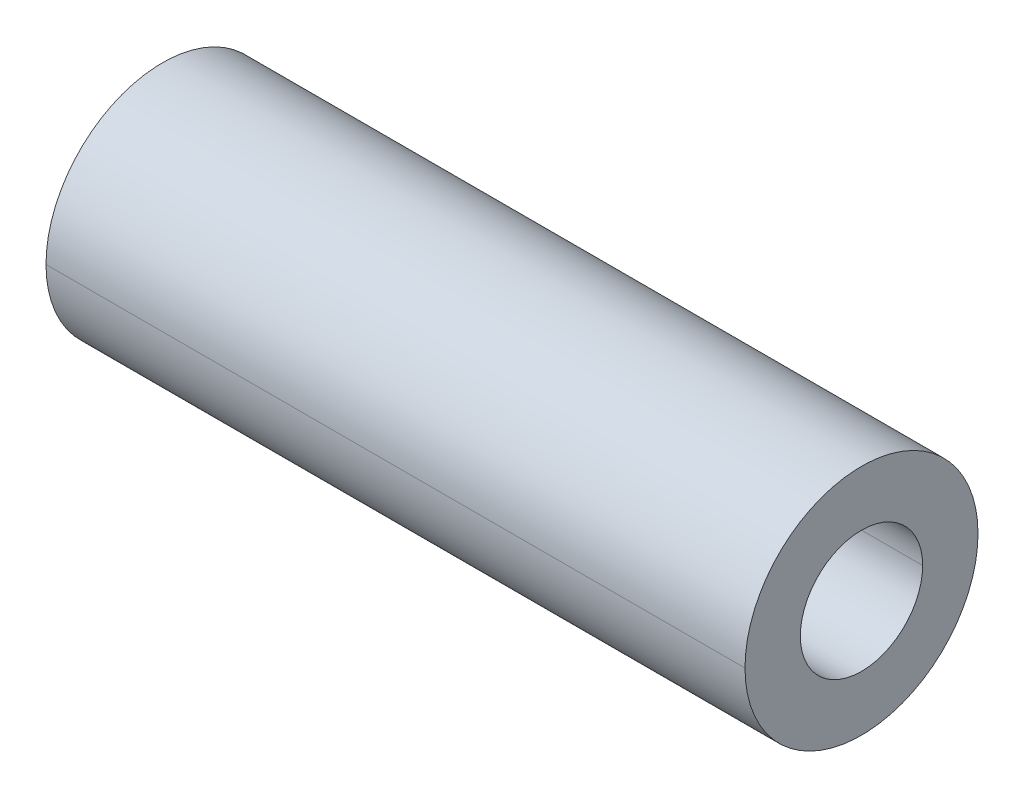
ISO-10303-21;
HEADER;
FILE_DESCRIPTION(('STEP AP214'),'2;1');
FILE_NAME('part.step','',(''),(''),'','','');
FILE_SCHEMA(('AUTOMOTIVE_DESIGN { 1 0 10303 214 1 1 1 1 }'));
ENDSEC;
DATA;
#1=APPLICATION_CONTEXT('core data for automotive mechanical design processes');
#2=APPLICATION_PROTOCOL_DEFINITION('international standard','automotive_design',2000,#1);
#3=PRODUCT_CONTEXT('',#1,'mechanical');
#4=PRODUCT('Part','Part','',(#3));
#5=PRODUCT_RELATED_PRODUCT_CATEGORY('part','',(#4));
#6=PRODUCT_DEFINITION_FORMATION('','',#4);
#7=PRODUCT_DEFINITION_CONTEXT('part definition',#1,'design');
#8=PRODUCT_DEFINITION('design','',#6,#7);
#9=PRODUCT_DEFINITION_SHAPE('','',#8);
#10=(LENGTH_UNIT() NAMED_UNIT(*) SI_UNIT(.MILLI.,.METRE.));
#11=(NAMED_UNIT(*) PLANE_ANGLE_UNIT() SI_UNIT($,.RADIAN.));
#12=(NAMED_UNIT(*) SI_UNIT($,.STERADIAN.) SOLID_ANGLE_UNIT());
#13=UNCERTAINTY_MEASURE_WITH_UNIT(LENGTH_MEASURE(1.E-05),#10,'distance_accuracy_value','');
#14=(GEOMETRIC_REPRESENTATION_CONTEXT(3) GLOBAL_UNCERTAINTY_ASSIGNED_CONTEXT((#13)) GLOBAL_UNIT_ASSIGNED_CONTEXT((#10,
#11,#12)) REPRESENTATION_CONTEXT('',''));
#15=CARTESIAN_POINT('',(0.,0.,0.));
#16=DIRECTION('',(0.,0.,1.));
#17=DIRECTION('',(1.,0.,0.));
#18=AXIS2_PLACEMENT_3D('',#15,#16,#17);
#19=CARTESIAN_POINT('',(-14.2875,0.,0.));
#20=DIRECTION('',(-1.,0.,0.));
#21=DIRECTION('',(0.,0.,1.));
#22=AXIS2_PLACEMENT_3D('',#19,#20,#21);
#23=CYLINDRICAL_SURFACE('',#22,4.7625);
#24=DIRECTION('',(-1.,0.,0.));
#25=VECTOR('',#24,1.);
#26=CARTESIAN_POINT('',(-14.2875,0.,-4.7625));
#27=LINE('',#26,#25);
#28=CARTESIAN_POINT('',(14.2875,0.,-4.7625));
#29=VERTEX_POINT('',#28);
#30=CARTESIAN_POINT('',(-14.2875,0.,-4.7625));
#31=VERTEX_POINT('',#30);
#32=EDGE_CURVE('E107',#29,#31,#27,.T.);
#33=ORIENTED_EDGE('',*,*,#32,.F.);
#34=CARTESIAN_POINT('',(14.2875,0.,0.));
#35=DIRECTION('',(-1.,0.,0.));
#36=DIRECTION('',(0.,0.,1.));
#37=AXIS2_PLACEMENT_3D('',#34,#35,#36);
#38=CIRCLE('',#37,4.7625);
#39=CARTESIAN_POINT('',(14.2875,0.,4.7625));
#40=VERTEX_POINT('',#39);
#41=EDGE_CURVE('E10',#29,#40,#38,.T.);
#42=ORIENTED_EDGE('',*,*,#41,.T.);
#43=DIRECTION('',(-1.,0.,0.));
#44=VECTOR('',#43,1.);
#45=CARTESIAN_POINT('',(-14.2875,0.,4.7625));
#46=LINE('',#45,#44);
#47=CARTESIAN_POINT('',(-14.2875,0.,4.7625));
#48=VERTEX_POINT('',#47);
#49=EDGE_CURVE('E97',#40,#48,#46,.T.);
#50=ORIENTED_EDGE('',*,*,#49,.T.);
#51=CARTESIAN_POINT('',(-14.2875,0.,0.));
#52=DIRECTION('',(-1.,0.,0.));
#53=DIRECTION('',(0.,0.,1.));
#54=AXIS2_PLACEMENT_3D('',#51,#52,#53);
#55=CIRCLE('',#54,4.7625);
#56=EDGE_CURVE('E55',#31,#48,#55,.T.);
#57=ORIENTED_EDGE('',*,*,#56,.F.);
#58=EDGE_LOOP('',(#33,#42,#50,#57));
#59=FACE_BOUND('',#58,.T.);
#60=ADVANCED_FACE('F15',(#59),#23,.T.);
#61=CARTESIAN_POINT('',(14.2875,4.7625,0.));
#62=DIRECTION('',(-1.,0.,0.));
#63=DIRECTION('',(0.,0.,1.));
#64=AXIS2_PLACEMENT_3D('',#61,#62,#63);
#65=PLANE('',#64);
#66=CARTESIAN_POINT('',(14.2875,0.,0.));
#67=DIRECTION('',(-1.,0.,0.));
#68=DIRECTION('',(0.,0.,1.));
#69=AXIS2_PLACEMENT_3D('',#66,#67,#68);
#70=CIRCLE('',#69,2.5);
#71=CARTESIAN_POINT('',(14.2875,0.,2.5));
#72=VERTEX_POINT('',#71);
#73=CARTESIAN_POINT('',(14.2875,0.,-2.5));
#74=VERTEX_POINT('',#73);
#75=EDGE_CURVE('E26',#72,#74,#70,.T.);
#76=ORIENTED_EDGE('',*,*,#75,.T.);
#77=CARTESIAN_POINT('',(14.2875,0.,0.));
#78=DIRECTION('',(-1.,0.,0.));
#79=DIRECTION('',(0.,0.,1.));
#80=AXIS2_PLACEMENT_3D('',#77,#78,#79);
#81=CIRCLE('',#80,2.5);
#82=EDGE_CURVE('E92',#74,#72,#81,.T.);
#83=ORIENTED_EDGE('',*,*,#82,.T.);
#84=EDGE_LOOP('',(#76,#83));
#85=FACE_BOUND('',#84,.T.);
#86=CARTESIAN_POINT('',(14.2875,0.,0.));
#87=DIRECTION('',(-1.,0.,0.));
#88=DIRECTION('',(0.,0.,1.));
#89=AXIS2_PLACEMENT_3D('',#86,#87,#88);
#90=CIRCLE('',#89,4.7625);
#91=EDGE_CURVE('E110',#40,#29,#90,.T.);
#92=ORIENTED_EDGE('',*,*,#91,.F.);
#93=ORIENTED_EDGE('',*,*,#41,.F.);
#94=EDGE_LOOP('',(#92,#93));
#95=FACE_BOUND('',#94,.T.);
#96=ADVANCED_FACE('F95',(#85,#95),#65,.F.);
#97=CARTESIAN_POINT('',(-14.2875,0.,0.));
#98=DIRECTION('',(-1.,0.,0.));
#99=DIRECTION('',(0.,0.,1.));
#100=AXIS2_PLACEMENT_3D('',#97,#98,#99);
#101=CYLINDRICAL_SURFACE('',#100,2.5);
#102=DIRECTION('',(-1.,0.,0.));
#103=VECTOR('',#102,1.);
#104=CARTESIAN_POINT('',(-14.2875,0.,-2.5));
#105=LINE('',#104,#103);
#106=CARTESIAN_POINT('',(-14.2875,0.,-2.5));
#107=VERTEX_POINT('',#106);
#108=EDGE_CURVE('E86',#74,#107,#105,.T.);
#109=ORIENTED_EDGE('',*,*,#108,.F.);
#110=ORIENTED_EDGE('',*,*,#75,.F.);
#111=DIRECTION('',(-1.,0.,0.));
#112=VECTOR('',#111,1.);
#113=CARTESIAN_POINT('',(-14.2875,0.,2.5));
#114=LINE('',#113,#112);
#115=CARTESIAN_POINT('',(-14.2875,0.,2.5));
#116=VERTEX_POINT('',#115);
#117=EDGE_CURVE('E19',#72,#116,#114,.T.);
#118=ORIENTED_EDGE('',*,*,#117,.T.);
#119=CARTESIAN_POINT('',(-14.2875,0.,0.));
#120=DIRECTION('',(-1.,0.,0.));
#121=DIRECTION('',(0.,0.,1.));
#122=AXIS2_PLACEMENT_3D('',#119,#120,#121);
#123=CIRCLE('',#122,2.5);
#124=EDGE_CURVE('E40',#116,#107,#123,.T.);
#125=ORIENTED_EDGE('',*,*,#124,.T.);
#126=EDGE_LOOP('',(#109,#110,#118,#125));
#127=FACE_BOUND('',#126,.T.);
#128=ADVANCED_FACE('F17',(#127),#101,.F.);
#129=CARTESIAN_POINT('',(-14.2875,4.7625,0.));
#130=DIRECTION('',(1.,0.,0.));
#131=DIRECTION('',(0.,1.,0.));
#132=AXIS2_PLACEMENT_3D('',#129,#130,#131);
#133=PLANE('',#132);
#134=ORIENTED_EDGE('',*,*,#124,.F.);
#135=CARTESIAN_POINT('',(-14.2875,0.,0.));
#136=DIRECTION('',(-1.,0.,0.));
#137=DIRECTION('',(0.,0.,1.));
#138=AXIS2_PLACEMENT_3D('',#135,#136,#137);
#139=CIRCLE('',#138,2.5);
#140=EDGE_CURVE('E93',#107,#116,#139,.T.);
#141=ORIENTED_EDGE('',*,*,#140,.F.);
#142=EDGE_LOOP('',(#134,#141));
#143=FACE_BOUND('',#142,.T.);
#144=CARTESIAN_POINT('',(-14.2875,0.,0.));
#145=DIRECTION('',(-1.,0.,0.));
#146=DIRECTION('',(0.,0.,1.));
#147=AXIS2_PLACEMENT_3D('',#144,#145,#146);
#148=CIRCLE('',#147,4.7625);
#149=EDGE_CURVE('E104',#48,#31,#148,.T.);
#150=ORIENTED_EDGE('',*,*,#149,.T.);
#151=ORIENTED_EDGE('',*,*,#56,.T.);
#152=EDGE_LOOP('',(#150,#151));
#153=FACE_BOUND('',#152,.T.);
#154=ADVANCED_FACE('F155',(#143,#153),#133,.F.);
#155=CARTESIAN_POINT('',(-14.2875,0.,0.));
#156=DIRECTION('',(-1.,0.,0.));
#157=DIRECTION('',(0.,0.,1.));
#158=AXIS2_PLACEMENT_3D('',#155,#156,#157);
#159=CYLINDRICAL_SURFACE('',#158,2.5);
#160=ORIENTED_EDGE('',*,*,#82,.F.);
#161=ORIENTED_EDGE('',*,*,#108,.T.);
#162=ORIENTED_EDGE('',*,*,#140,.T.);
#163=ORIENTED_EDGE('',*,*,#117,.F.);
#164=EDGE_LOOP('',(#160,#161,#162,#163));
#165=FACE_BOUND('',#164,.T.);
#166=ADVANCED_FACE('F91',(#165),#159,.F.);
#167=CARTESIAN_POINT('',(-14.2875,0.,0.));
#168=DIRECTION('',(-1.,0.,0.));
#169=DIRECTION('',(0.,0.,1.));
#170=AXIS2_PLACEMENT_3D('',#167,#168,#169);
#171=CYLINDRICAL_SURFACE('',#170,4.7625);
#172=ORIENTED_EDGE('',*,*,#91,.T.);
#173=ORIENTED_EDGE('',*,*,#32,.T.);
#174=ORIENTED_EDGE('',*,*,#149,.F.);
#175=ORIENTED_EDGE('',*,*,#49,.F.);
#176=EDGE_LOOP('',(#172,#173,#174,#175));
#177=FACE_BOUND('',#176,.T.);
#178=ADVANCED_FACE('F154',(#177),#171,.T.);
#179=CLOSED_SHELL('',(#60,#96,#128,#154,#166,#178));
#180=MANIFOLD_SOLID_BREP('B1',#179);
#181=ADVANCED_BREP_SHAPE_REPRESENTATION('',(#18,#180),#14);
#182=SHAPE_DEFINITION_REPRESENTATION(#9,#181);
ENDSEC;
END-ISO-10303-21;
